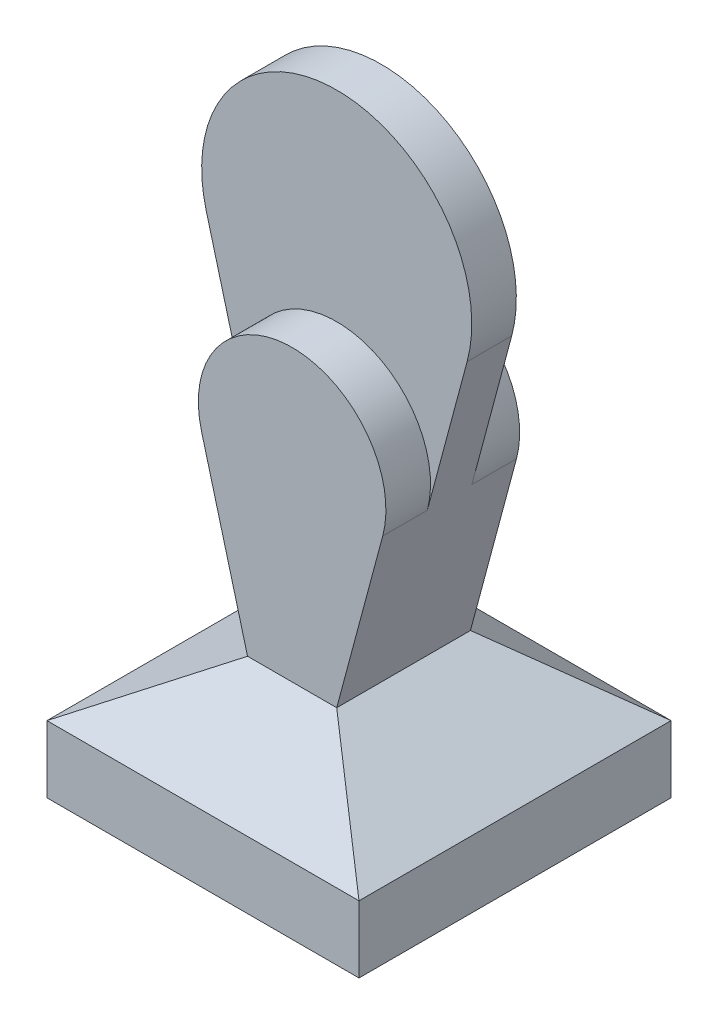
ISO-10303-21;
HEADER;
FILE_DESCRIPTION(('STEP AP214'),'2;1');
FILE_NAME('part.step','',(''),(''),'','','');
FILE_SCHEMA(('AUTOMOTIVE_DESIGN { 1 0 10303 214 1 1 1 1 }'));
ENDSEC;
DATA;
#1=APPLICATION_CONTEXT('core data for automotive mechanical design processes');
#2=APPLICATION_PROTOCOL_DEFINITION('international standard','automotive_design',2000,#1);
#3=PRODUCT_CONTEXT('',#1,'mechanical');
#4=PRODUCT('Part','Part','',(#3));
#5=PRODUCT_RELATED_PRODUCT_CATEGORY('part','',(#4));
#6=PRODUCT_DEFINITION_FORMATION('','',#4);
#7=PRODUCT_DEFINITION_CONTEXT('part definition',#1,'design');
#8=PRODUCT_DEFINITION('design','',#6,#7);
#9=PRODUCT_DEFINITION_SHAPE('','',#8);
#10=(LENGTH_UNIT() NAMED_UNIT(*) SI_UNIT(.MILLI.,.METRE.));
#11=(NAMED_UNIT(*) PLANE_ANGLE_UNIT() SI_UNIT($,.RADIAN.));
#12=(NAMED_UNIT(*) SI_UNIT($,.STERADIAN.) SOLID_ANGLE_UNIT());
#13=UNCERTAINTY_MEASURE_WITH_UNIT(LENGTH_MEASURE(1.E-05),#10,'distance_accuracy_value','');
#14=(GEOMETRIC_REPRESENTATION_CONTEXT(3) GLOBAL_UNCERTAINTY_ASSIGNED_CONTEXT((#13)) GLOBAL_UNIT_ASSIGNED_CONTEXT((#10,
#11,#12)) REPRESENTATION_CONTEXT('',''));
#15=CARTESIAN_POINT('',(0.,0.,0.));
#16=DIRECTION('',(0.,0.,1.));
#17=DIRECTION('',(1.,0.,0.));
#18=AXIS2_PLACEMENT_3D('',#15,#16,#17);
#19=CARTESIAN_POINT('',(0.,109.710218976658,5.));
#20=DIRECTION('',(0.,0.,1.));
#21=DIRECTION('',(1.,0.,0.));
#22=AXIS2_PLACEMENT_3D('',#19,#20,#21);
#23=PLANE('',#22);
#24=DIRECTION('',(0.258819045102518,-0.965925826289069,0.));
#25=VECTOR('',#24,1.);
#26=CARTESIAN_POINT('',(-10.,30.,5.));
#27=LINE('',#26,#25);
#28=CARTESIAN_POINT('',(-29.2576817630868,101.870646775832,5.));
#29=VERTEX_POINT('',#28);
#30=CARTESIAN_POINT('',(-20.3207340391317,68.5175038054454,5.));
#31=VERTEX_POINT('',#30);
#32=EDGE_CURVE('E56',#29,#31,#27,.T.);
#33=ORIENTED_EDGE('',*,*,#32,.T.);
#34=CARTESIAN_POINT('',(0.,73.9624280808384,5.));
#35=DIRECTION('',(0.,0.,1.));
#36=DIRECTION('',(1.,0.,0.));
#37=AXIS2_PLACEMENT_3D('',#34,#35,#36);
#38=CIRCLE('',#37,21.0375719191616);
#39=CARTESIAN_POINT('',(20.3207340391319,68.5175038054452,5.));
#40=VERTEX_POINT('',#39);
#41=EDGE_CURVE('E164',#31,#40,#38,.F.);
#42=ORIENTED_EDGE('',*,*,#41,.T.);
#43=DIRECTION('',(0.258819045102524,0.965925826289067,0.));
#44=VECTOR('',#43,1.);
#45=CARTESIAN_POINT('',(10.,30.,5.));
#46=LINE('',#45,#44);
#47=CARTESIAN_POINT('',(29.2576817630869,101.870646775832,5.));
#48=VERTEX_POINT('',#47);
#49=EDGE_CURVE('E171',#40,#48,#46,.T.);
#50=ORIENTED_EDGE('',*,*,#49,.T.);
#51=CARTESIAN_POINT('',(0.,109.710218976658,5.));
#52=DIRECTION('',(0.,0.,1.));
#53=DIRECTION('',(1.,0.,0.));
#54=AXIS2_PLACEMENT_3D('',#51,#52,#53);
#55=CIRCLE('',#54,30.2897810233422);
#56=EDGE_CURVE('E169',#48,#29,#55,.T.);
#57=ORIENTED_EDGE('',*,*,#56,.T.);
#58=EDGE_LOOP('',(#33,#42,#50,#57));
#59=FACE_BOUND('',#58,.T.);
#60=ADVANCED_FACE('F38',(#59),#23,.T.);
#61=CARTESIAN_POINT('',(0.,109.710218976658,-5.));
#62=DIRECTION('',(0.,0.,1.));
#63=DIRECTION('',(1.,0.,0.));
#64=AXIS2_PLACEMENT_3D('',#61,#62,#63);
#65=PLANE('',#64);
#66=CARTESIAN_POINT('',(0.,73.9624280808384,-5.));
#67=DIRECTION('',(0.,0.,1.));
#68=DIRECTION('',(1.,0.,0.));
#69=AXIS2_PLACEMENT_3D('',#66,#67,#68);
#70=CIRCLE('',#69,21.0375719191616);
#71=CARTESIAN_POINT('',(-20.3207340391318,68.5175038054453,-5.));
#72=VERTEX_POINT('',#71);
#73=CARTESIAN_POINT('',(20.3207340391319,68.5175038054452,-5.));
#74=VERTEX_POINT('',#73);
#75=EDGE_CURVE('E12',#72,#74,#70,.F.);
#76=ORIENTED_EDGE('',*,*,#75,.F.);
#77=DIRECTION('',(0.258819045102518,-0.965925826289069,0.));
#78=VECTOR('',#77,1.);
#79=CARTESIAN_POINT('',(-10.,30.,-5.));
#80=LINE('',#79,#78);
#81=CARTESIAN_POINT('',(-29.2576817630868,101.870646775832,-5.));
#82=VERTEX_POINT('',#81);
#83=EDGE_CURVE('E136',#82,#72,#80,.T.);
#84=ORIENTED_EDGE('',*,*,#83,.F.);
#85=CARTESIAN_POINT('',(0.,109.710218976658,-5.));
#86=DIRECTION('',(0.,0.,1.));
#87=DIRECTION('',(1.,0.,0.));
#88=AXIS2_PLACEMENT_3D('',#85,#86,#87);
#89=CIRCLE('',#88,30.2897810233422);
#90=CARTESIAN_POINT('',(29.2576817630869,101.870646775832,-5.));
#91=VERTEX_POINT('',#90);
#92=EDGE_CURVE('E167',#91,#82,#89,.T.);
#93=ORIENTED_EDGE('',*,*,#92,.F.);
#94=DIRECTION('',(0.258819045102524,0.965925826289067,0.));
#95=VECTOR('',#94,1.);
#96=CARTESIAN_POINT('',(10.,30.,-5.));
#97=LINE('',#96,#95);
#98=EDGE_CURVE('E166',#74,#91,#97,.T.);
#99=ORIENTED_EDGE('',*,*,#98,.F.);
#100=EDGE_LOOP('',(#76,#84,#93,#99));
#101=FACE_BOUND('',#100,.T.);
#102=ADVANCED_FACE('F361',(#101),#65,.F.);
#103=CARTESIAN_POINT('',(-35.,15.,-35.));
#104=DIRECTION('',(1.,0.,0.));
#105=DIRECTION('',(0.,0.,-1.));
#106=AXIS2_PLACEMENT_3D('',#103,#104,#105);
#107=PLANE('',#106);
#108=DIRECTION('',(0.,0.,1.));
#109=VECTOR('',#108,1.);
#110=CARTESIAN_POINT('',(-35.,0.,-35.));
#111=LINE('',#110,#109);
#112=CARTESIAN_POINT('',(-35.,0.,-35.));
#113=VERTEX_POINT('',#112);
#114=CARTESIAN_POINT('',(-35.,0.,35.));
#115=VERTEX_POINT('',#114);
#116=EDGE_CURVE('E181',#113,#115,#111,.T.);
#117=ORIENTED_EDGE('',*,*,#116,.T.);
#118=DIRECTION('',(0.,-1.,0.));
#119=VECTOR('',#118,1.);
#120=CARTESIAN_POINT('',(-35.,15.,35.));
#121=LINE('',#120,#119);
#122=CARTESIAN_POINT('',(-35.,15.,35.));
#123=VERTEX_POINT('',#122);
#124=EDGE_CURVE('E48',#123,#115,#121,.T.);
#125=ORIENTED_EDGE('',*,*,#124,.F.);
#126=DIRECTION('',(0.,0.,1.));
#127=VECTOR('',#126,1.);
#128=CARTESIAN_POINT('',(-35.,15.,0.));
#129=LINE('',#128,#127);
#130=CARTESIAN_POINT('',(-35.,15.,-35.));
#131=VERTEX_POINT('',#130);
#132=EDGE_CURVE('E266',#131,#123,#129,.T.);
#133=ORIENTED_EDGE('',*,*,#132,.F.);
#134=DIRECTION('',(0.,-1.,0.));
#135=VECTOR('',#134,1.);
#136=CARTESIAN_POINT('',(-35.,15.,-35.));
#137=LINE('',#136,#135);
#138=EDGE_CURVE('E267',#131,#113,#137,.T.);
#139=ORIENTED_EDGE('',*,*,#138,.T.);
#140=EDGE_LOOP('',(#117,#125,#133,#139));
#141=FACE_BOUND('',#140,.T.);
#142=ADVANCED_FACE('F40',(#141),#107,.F.);
#143=CARTESIAN_POINT('',(-35.,15.,35.));
#144=DIRECTION('',(0.,0.,-1.));
#145=DIRECTION('',(-1.,0.,0.));
#146=AXIS2_PLACEMENT_3D('',#143,#144,#145);
#147=PLANE('',#146);
#148=DIRECTION('',(1.,0.,0.));
#149=VECTOR('',#148,1.);
#150=CARTESIAN_POINT('',(-35.,0.,35.));
#151=LINE('',#150,#149);
#152=CARTESIAN_POINT('',(35.,0.,35.));
#153=VERTEX_POINT('',#152);
#154=EDGE_CURVE('E260',#115,#153,#151,.T.);
#155=ORIENTED_EDGE('',*,*,#154,.T.);
#156=DIRECTION('',(0.,-1.,0.));
#157=VECTOR('',#156,1.);
#158=CARTESIAN_POINT('',(35.,15.,35.));
#159=LINE('',#158,#157);
#160=CARTESIAN_POINT('',(35.,15.,35.));
#161=VERTEX_POINT('',#160);
#162=EDGE_CURVE('E274',#161,#153,#159,.T.);
#163=ORIENTED_EDGE('',*,*,#162,.F.);
#164=DIRECTION('',(1.,0.,0.));
#165=VECTOR('',#164,1.);
#166=CARTESIAN_POINT('',(0.,15.,35.));
#167=LINE('',#166,#165);
#168=EDGE_CURVE('E281',#123,#161,#167,.T.);
#169=ORIENTED_EDGE('',*,*,#168,.F.);
#170=ORIENTED_EDGE('',*,*,#124,.T.);
#171=EDGE_LOOP('',(#155,#163,#169,#170));
#172=FACE_BOUND('',#171,.T.);
#173=ADVANCED_FACE('F352',(#172),#147,.F.);
#174=CARTESIAN_POINT('',(35.,15.,-35.));
#175=DIRECTION('',(-1.,0.,0.));
#176=DIRECTION('',(0.,0.,1.));
#177=AXIS2_PLACEMENT_3D('',#174,#175,#176);
#178=PLANE('',#177);
#179=DIRECTION('',(0.,0.,-1.));
#180=VECTOR('',#179,1.);
#181=CARTESIAN_POINT('',(35.,0.,-35.));
#182=LINE('',#181,#180);
#183=CARTESIAN_POINT('',(35.,0.,-35.));
#184=VERTEX_POINT('',#183);
#185=EDGE_CURVE('E262',#153,#184,#182,.T.);
#186=ORIENTED_EDGE('',*,*,#185,.T.);
#187=DIRECTION('',(0.,-1.,0.));
#188=VECTOR('',#187,1.);
#189=CARTESIAN_POINT('',(35.,15.,-35.));
#190=LINE('',#189,#188);
#191=CARTESIAN_POINT('',(35.,15.,-35.));
#192=VERTEX_POINT('',#191);
#193=EDGE_CURVE('E270',#192,#184,#190,.T.);
#194=ORIENTED_EDGE('',*,*,#193,.F.);
#195=DIRECTION('',(0.,0.,1.));
#196=VECTOR('',#195,1.);
#197=CARTESIAN_POINT('',(35.,15.,0.));
#198=LINE('',#197,#196);
#199=EDGE_CURVE('E284',#161,#192,#198,.F.);
#200=ORIENTED_EDGE('',*,*,#199,.F.);
#201=ORIENTED_EDGE('',*,*,#162,.T.);
#202=EDGE_LOOP('',(#186,#194,#200,#201));
#203=FACE_BOUND('',#202,.T.);
#204=ADVANCED_FACE('F354',(#203),#178,.F.);
#205=CARTESIAN_POINT('',(-35.,15.,-35.));
#206=DIRECTION('',(0.,0.,1.));
#207=DIRECTION('',(1.,0.,0.));
#208=AXIS2_PLACEMENT_3D('',#205,#206,#207);
#209=PLANE('',#208);
#210=DIRECTION('',(-1.,0.,0.));
#211=VECTOR('',#210,1.);
#212=CARTESIAN_POINT('',(-35.,0.,-35.));
#213=LINE('',#212,#211);
#214=EDGE_CURVE('E264',#184,#113,#213,.T.);
#215=ORIENTED_EDGE('',*,*,#214,.T.);
#216=ORIENTED_EDGE('',*,*,#138,.F.);
#217=DIRECTION('',(1.,0.,0.));
#218=VECTOR('',#217,1.);
#219=CARTESIAN_POINT('',(0.,15.,-35.));
#220=LINE('',#219,#218);
#221=EDGE_CURVE('E271',#192,#131,#220,.F.);
#222=ORIENTED_EDGE('',*,*,#221,.F.);
#223=ORIENTED_EDGE('',*,*,#193,.T.);
#224=EDGE_LOOP('',(#215,#216,#222,#223));
#225=FACE_BOUND('',#224,.T.);
#226=ADVANCED_FACE('F346',(#225),#209,.F.);
#227=CARTESIAN_POINT('',(-35.,0.,35.));
#228=DIRECTION('',(0.,1.,0.));
#229=DIRECTION('',(0.,0.,1.));
#230=AXIS2_PLACEMENT_3D('',#227,#228,#229);
#231=PLANE('',#230);
#232=ORIENTED_EDGE('',*,*,#116,.F.);
#233=ORIENTED_EDGE('',*,*,#214,.F.);
#234=ORIENTED_EDGE('',*,*,#185,.F.);
#235=ORIENTED_EDGE('',*,*,#154,.F.);
#236=EDGE_LOOP('',(#232,#233,#234,#235));
#237=FACE_BOUND('',#236,.T.);
#238=ADVANCED_FACE('F222',(#237),#231,.F.);
#239=CARTESIAN_POINT('',(0.,36.,-7.));
#240=DIRECTION('',(0.,-0.8,0.6));
#241=DIRECTION('',(0.,-0.6,-0.8));
#242=AXIS2_PLACEMENT_3D('',#239,#240,#241);
#243=PLANE('',#242);
#244=DIRECTION('',(0.707106781186548,0.424264068711928,0.565685424949238));
#245=VECTOR('',#244,1.);
#246=CARTESIAN_POINT('',(-35.,15.,-35.));
#247=LINE('',#246,#245);
#248=CARTESIAN_POINT('',(-10.,30.,-15.));
#249=VERTEX_POINT('',#248);
#250=EDGE_CURVE('E182',#131,#249,#247,.T.);
#251=ORIENTED_EDGE('',*,*,#250,.T.);
#252=DIRECTION('',(-1.,0.,0.));
#253=VECTOR('',#252,1.);
#254=CARTESIAN_POINT('',(9.99999999999999,30.,-15.));
#255=LINE('',#254,#253);
#256=CARTESIAN_POINT('',(10.,30.,-15.));
#257=VERTEX_POINT('',#256);
#258=EDGE_CURVE('E149',#257,#249,#255,.T.);
#259=ORIENTED_EDGE('',*,*,#258,.F.);
#260=DIRECTION('',(-0.707106781186548,0.424264068711928,0.565685424949238));
#261=VECTOR('',#260,1.);
#262=CARTESIAN_POINT('',(35.,15.,-35.));
#263=LINE('',#262,#261);
#264=EDGE_CURVE('E178',#192,#257,#263,.T.);
#265=ORIENTED_EDGE('',*,*,#264,.F.);
#266=ORIENTED_EDGE('',*,*,#221,.T.);
#267=EDGE_LOOP('',(#251,#259,#265,#266));
#268=FACE_BOUND('',#267,.T.);
#269=ADVANCED_FACE('F230',(#268),#243,.F.);
#270=CARTESIAN_POINT('',(-8.74999999999999,41.25,0.));
#271=DIRECTION('',(-0.514495755427526,-0.857492925712544,0.));
#272=DIRECTION('',(0.857492925712544,-0.514495755427526,0.));
#273=AXIS2_PLACEMENT_3D('',#270,#271,#272);
#274=PLANE('',#273);
#275=ORIENTED_EDGE('',*,*,#264,.T.);
#276=DIRECTION('',(0.,0.,-1.));
#277=VECTOR('',#276,1.);
#278=CARTESIAN_POINT('',(10.,30.,15.));
#279=LINE('',#278,#277);
#280=CARTESIAN_POINT('',(10.,30.,15.));
#281=VERTEX_POINT('',#280);
#282=EDGE_CURVE('E177',#281,#257,#279,.T.);
#283=ORIENTED_EDGE('',*,*,#282,.F.);
#284=DIRECTION('',(-0.707106781186547,0.424264068711928,-0.565685424949238));
#285=VECTOR('',#284,1.);
#286=CARTESIAN_POINT('',(35.,15.,35.));
#287=LINE('',#286,#285);
#288=EDGE_CURVE('E192',#161,#281,#287,.T.);
#289=ORIENTED_EDGE('',*,*,#288,.F.);
#290=ORIENTED_EDGE('',*,*,#199,.T.);
#291=EDGE_LOOP('',(#275,#283,#289,#290));
#292=FACE_BOUND('',#291,.T.);
#293=ADVANCED_FACE('F226',(#292),#274,.F.);
#294=CARTESIAN_POINT('',(8.75000000000001,41.25,0.));
#295=DIRECTION('',(0.514495755427526,-0.857492925712544,0.));
#296=DIRECTION('',(0.857492925712544,0.514495755427526,0.));
#297=AXIS2_PLACEMENT_3D('',#294,#295,#296);
#298=PLANE('',#297);
#299=DIRECTION('',(0.707106781186548,0.424264068711928,-0.565685424949238));
#300=VECTOR('',#299,1.);
#301=CARTESIAN_POINT('',(-35.,15.,35.));
#302=LINE('',#301,#300);
#303=CARTESIAN_POINT('',(-10.,30.,15.));
#304=VERTEX_POINT('',#303);
#305=EDGE_CURVE('E187',#123,#304,#302,.T.);
#306=ORIENTED_EDGE('',*,*,#305,.T.);
#307=DIRECTION('',(0.,0.,1.));
#308=VECTOR('',#307,1.);
#309=CARTESIAN_POINT('',(-10.,30.,15.));
#310=LINE('',#309,#308);
#311=EDGE_CURVE('E249',#249,#304,#310,.T.);
#312=ORIENTED_EDGE('',*,*,#311,.F.);
#313=ORIENTED_EDGE('',*,*,#250,.F.);
#314=ORIENTED_EDGE('',*,*,#132,.T.);
#315=EDGE_LOOP('',(#306,#312,#313,#314));
#316=FACE_BOUND('',#315,.T.);
#317=ADVANCED_FACE('F221',(#316),#298,.F.);
#318=CARTESIAN_POINT('',(0.,36.,7.));
#319=DIRECTION('',(0.,-0.8,-0.6));
#320=DIRECTION('',(0.,0.6,-0.8));
#321=AXIS2_PLACEMENT_3D('',#318,#319,#320);
#322=PLANE('',#321);
#323=ORIENTED_EDGE('',*,*,#288,.T.);
#324=DIRECTION('',(1.,0.,0.));
#325=VECTOR('',#324,1.);
#326=CARTESIAN_POINT('',(10.,30.,15.));
#327=LINE('',#326,#325);
#328=EDGE_CURVE('E42',#304,#281,#327,.T.);
#329=ORIENTED_EDGE('',*,*,#328,.F.);
#330=ORIENTED_EDGE('',*,*,#305,.F.);
#331=ORIENTED_EDGE('',*,*,#168,.T.);
#332=EDGE_LOOP('',(#323,#329,#330,#331));
#333=FACE_BOUND('',#332,.T.);
#334=ADVANCED_FACE('F210',(#333),#322,.F.);
#335=CARTESIAN_POINT('',(10.,30.,5.));
#336=DIRECTION('',(-0.965925826289067,0.258819045102524,0.));
#337=DIRECTION('',(-0.258819045102524,-0.965925826289067,0.));
#338=AXIS2_PLACEMENT_3D('',#335,#336,#337);
#339=PLANE('',#338);
#340=ORIENTED_EDGE('',*,*,#282,.T.);
#341=DIRECTION('',(0.258819045102524,0.965925826289067,0.));
#342=VECTOR('',#341,1.);
#343=CARTESIAN_POINT('',(20.3207340391319,68.5175038054452,-15.));
#344=LINE('',#343,#342);
#345=CARTESIAN_POINT('',(20.3207340391319,68.5175038054452,-15.));
#346=VERTEX_POINT('',#345);
#347=EDGE_CURVE('E152',#257,#346,#344,.T.);
#348=ORIENTED_EDGE('',*,*,#347,.T.);
#349=DIRECTION('',(0.,0.,-1.));
#350=VECTOR('',#349,1.);
#351=CARTESIAN_POINT('',(20.3207340391319,68.5175038054452,15.));
#352=LINE('',#351,#350);
#353=EDGE_CURVE('E64',#74,#346,#352,.T.);
#354=ORIENTED_EDGE('',*,*,#353,.F.);
#355=ORIENTED_EDGE('',*,*,#98,.T.);
#356=DIRECTION('',(0.,0.,-1.));
#357=VECTOR('',#356,1.);
#358=CARTESIAN_POINT('',(29.2576817630869,101.870646775832,5.));
#359=LINE('',#358,#357);
#360=EDGE_CURVE('E174',#48,#91,#359,.T.);
#361=ORIENTED_EDGE('',*,*,#360,.F.);
#362=ORIENTED_EDGE('',*,*,#49,.F.);
#363=CARTESIAN_POINT('',(20.3207340391319,68.5175038054452,15.));
#364=VERTEX_POINT('',#363);
#365=EDGE_CURVE('E141',#364,#40,#352,.T.);
#366=ORIENTED_EDGE('',*,*,#365,.F.);
#367=DIRECTION('',(0.258819045102524,0.965925826289067,0.));
#368=VECTOR('',#367,1.);
#369=CARTESIAN_POINT('',(20.3207340391319,68.5175038054452,15.));
#370=LINE('',#369,#368);
#371=EDGE_CURVE('E327',#281,#364,#370,.T.);
#372=ORIENTED_EDGE('',*,*,#371,.F.);
#373=EDGE_LOOP('',(#340,#348,#354,#355,#361,#362,#366,#372));
#374=FACE_BOUND('',#373,.T.);
#375=ADVANCED_FACE('F220',(#374),#339,.F.);
#376=CARTESIAN_POINT('',(0.,109.710218976658,5.));
#377=DIRECTION('',(0.,0.,-1.));
#378=DIRECTION('',(-1.,0.,0.));
#379=AXIS2_PLACEMENT_3D('',#376,#377,#378);
#380=CYLINDRICAL_SURFACE('',#379,30.2897810233422);
#381=ORIENTED_EDGE('',*,*,#92,.T.);
#382=DIRECTION('',(0.,0.,-1.));
#383=VECTOR('',#382,1.);
#384=CARTESIAN_POINT('',(-29.2576817630868,101.870646775832,5.));
#385=LINE('',#384,#383);
#386=EDGE_CURVE('E172',#29,#82,#385,.T.);
#387=ORIENTED_EDGE('',*,*,#386,.F.);
#388=ORIENTED_EDGE('',*,*,#56,.F.);
#389=ORIENTED_EDGE('',*,*,#360,.T.);
#390=EDGE_LOOP('',(#381,#387,#388,#389));
#391=FACE_BOUND('',#390,.T.);
#392=ADVANCED_FACE('F370',(#391),#380,.T.);
#393=CARTESIAN_POINT('',(-10.,30.,5.));
#394=DIRECTION('',(0.965925826289069,0.258819045102518,0.));
#395=DIRECTION('',(-0.258819045102518,0.965925826289069,0.));
#396=AXIS2_PLACEMENT_3D('',#393,#394,#395);
#397=PLANE('',#396);
#398=ORIENTED_EDGE('',*,*,#83,.T.);
#399=DIRECTION('',(0.,0.,-1.));
#400=VECTOR('',#399,1.);
#401=CARTESIAN_POINT('',(-20.3207340391318,68.5175038054453,15.));
#402=LINE('',#401,#400);
#403=CARTESIAN_POINT('',(-20.3207340391318,68.5175038054453,-15.));
#404=VERTEX_POINT('',#403);
#405=EDGE_CURVE('E129',#72,#404,#402,.T.);
#406=ORIENTED_EDGE('',*,*,#405,.T.);
#407=DIRECTION('',(0.258819045102521,-0.965925826289068,0.));
#408=VECTOR('',#407,1.);
#409=CARTESIAN_POINT('',(-10.,30.,-15.));
#410=LINE('',#409,#408);
#411=EDGE_CURVE('E132',#404,#249,#410,.T.);
#412=ORIENTED_EDGE('',*,*,#411,.T.);
#413=ORIENTED_EDGE('',*,*,#311,.T.);
#414=DIRECTION('',(0.258819045102521,-0.965925826289068,0.));
#415=VECTOR('',#414,1.);
#416=CARTESIAN_POINT('',(-10.,30.,15.));
#417=LINE('',#416,#415);
#418=CARTESIAN_POINT('',(-20.3207340391318,68.5175038054453,15.));
#419=VERTEX_POINT('',#418);
#420=EDGE_CURVE('E160',#419,#304,#417,.T.);
#421=ORIENTED_EDGE('',*,*,#420,.F.);
#422=EDGE_CURVE('E140',#419,#31,#402,.T.);
#423=ORIENTED_EDGE('',*,*,#422,.T.);
#424=ORIENTED_EDGE('',*,*,#32,.F.);
#425=ORIENTED_EDGE('',*,*,#386,.T.);
#426=EDGE_LOOP('',(#398,#406,#412,#413,#421,#423,#424,#425));
#427=FACE_BOUND('',#426,.T.);
#428=ADVANCED_FACE('F131',(#427),#397,.F.);
#429=CARTESIAN_POINT('',(0.,73.9624280808384,15.));
#430=DIRECTION('',(0.,0.,-1.));
#431=DIRECTION('',(-1.,0.,0.));
#432=AXIS2_PLACEMENT_3D('',#429,#430,#431);
#433=CYLINDRICAL_SURFACE('',#432,21.0375719191616);
#434=ORIENTED_EDGE('',*,*,#405,.F.);
#435=ORIENTED_EDGE('',*,*,#75,.T.);
#436=ORIENTED_EDGE('',*,*,#353,.T.);
#437=CARTESIAN_POINT('',(0.,73.9624280808384,-15.));
#438=DIRECTION('',(0.,0.,1.));
#439=DIRECTION('',(1.,0.,0.));
#440=AXIS2_PLACEMENT_3D('',#437,#438,#439);
#441=CIRCLE('',#440,21.0375719191616);
#442=EDGE_CURVE('E147',#346,#404,#441,.T.);
#443=ORIENTED_EDGE('',*,*,#442,.T.);
#444=EDGE_LOOP('',(#434,#435,#436,#443));
#445=FACE_BOUND('',#444,.T.);
#446=ADVANCED_FACE('F154',(#445),#433,.T.);
#447=CARTESIAN_POINT('',(0.,73.9624280808384,-15.));
#448=DIRECTION('',(0.,0.,1.));
#449=DIRECTION('',(1.,0.,0.));
#450=AXIS2_PLACEMENT_3D('',#447,#448,#449);
#451=PLANE('',#450);
#452=ORIENTED_EDGE('',*,*,#442,.F.);
#453=ORIENTED_EDGE('',*,*,#347,.F.);
#454=ORIENTED_EDGE('',*,*,#258,.T.);
#455=ORIENTED_EDGE('',*,*,#411,.F.);
#456=EDGE_LOOP('',(#452,#453,#454,#455));
#457=FACE_BOUND('',#456,.T.);
#458=ADVANCED_FACE('F145',(#457),#451,.F.);
#459=ORIENTED_EDGE('',*,*,#41,.F.);
#460=ORIENTED_EDGE('',*,*,#422,.F.);
#461=CARTESIAN_POINT('',(0.,73.9624280808384,15.));
#462=DIRECTION('',(0.,0.,1.));
#463=DIRECTION('',(1.,0.,0.));
#464=AXIS2_PLACEMENT_3D('',#461,#462,#463);
#465=CIRCLE('',#464,21.0375719191616);
#466=EDGE_CURVE('E157',#364,#419,#465,.T.);
#467=ORIENTED_EDGE('',*,*,#466,.F.);
#468=ORIENTED_EDGE('',*,*,#365,.T.);
#469=EDGE_LOOP('',(#459,#460,#467,#468));
#470=FACE_BOUND('',#469,.T.);
#471=ADVANCED_FACE('F310',(#470),#433,.T.);
#472=CARTESIAN_POINT('',(0.,73.9624280808384,15.));
#473=DIRECTION('',(0.,0.,1.));
#474=DIRECTION('',(1.,0.,0.));
#475=AXIS2_PLACEMENT_3D('',#472,#473,#474);
#476=PLANE('',#475);
#477=ORIENTED_EDGE('',*,*,#466,.T.);
#478=ORIENTED_EDGE('',*,*,#420,.T.);
#479=ORIENTED_EDGE('',*,*,#328,.T.);
#480=ORIENTED_EDGE('',*,*,#371,.T.);
#481=EDGE_LOOP('',(#477,#478,#479,#480));
#482=FACE_BOUND('',#481,.T.);
#483=ADVANCED_FACE('F311',(#482),#476,.T.);
#484=CLOSED_SHELL('',(#60,#102,#142,#173,#204,#226,#238,#269,#293,#317,#334,#375,#392,#428,#446,
#458,#471,#483));
#485=MANIFOLD_SOLID_BREP('B2',#484);
#486=ADVANCED_BREP_SHAPE_REPRESENTATION('',(#18,#485),#14);
#487=SHAPE_DEFINITION_REPRESENTATION(#9,#486);
ENDSEC;
END-ISO-10303-21;
